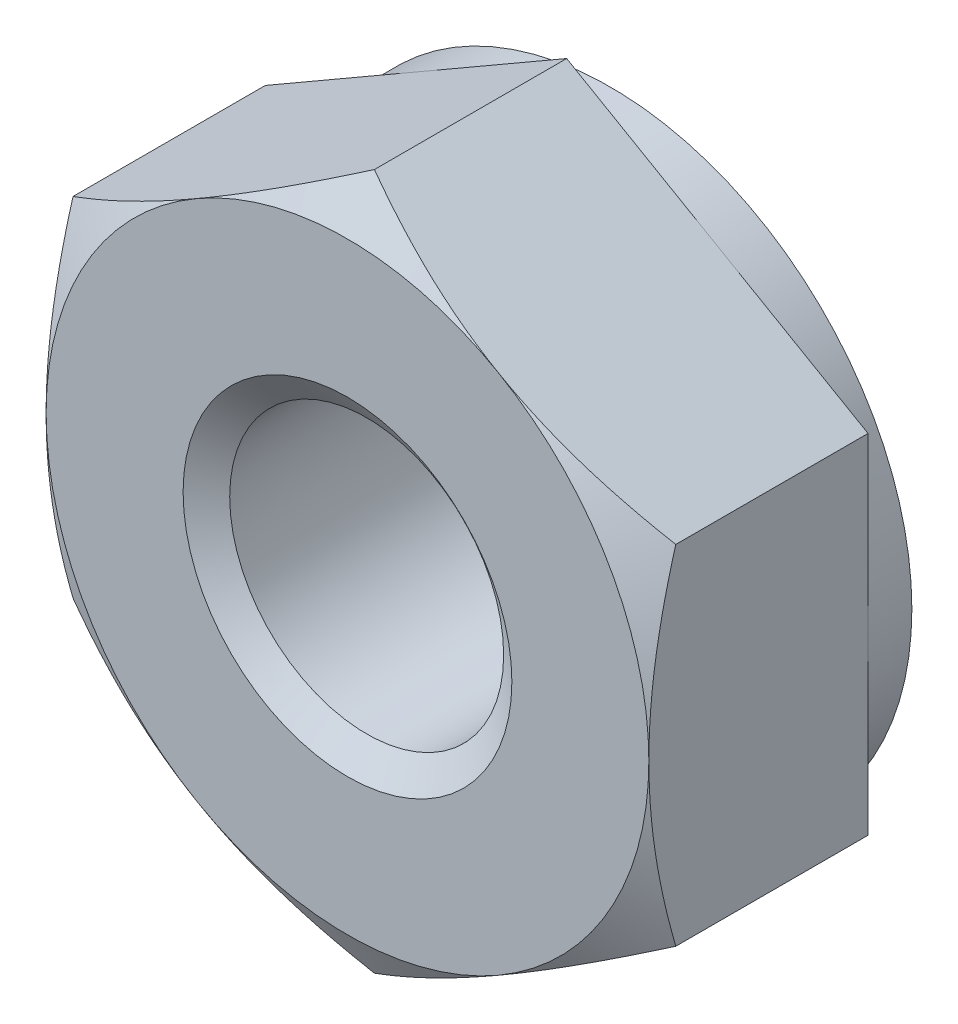
ISO-10303-21;
HEADER;
FILE_DESCRIPTION(('STEP AP214'),'2;1');
FILE_NAME('part.step','',(''),(''),'','','');
FILE_SCHEMA(('AUTOMOTIVE_DESIGN { 1 0 10303 214 1 1 1 1 }'));
ENDSEC;
DATA;
#1=APPLICATION_CONTEXT('core data for automotive mechanical design processes');
#2=APPLICATION_PROTOCOL_DEFINITION('international standard','automotive_design',2000,#1);
#3=PRODUCT_CONTEXT('',#1,'mechanical');
#4=PRODUCT('Part','Part','',(#3));
#5=PRODUCT_RELATED_PRODUCT_CATEGORY('part','',(#4));
#6=PRODUCT_DEFINITION_FORMATION('','',#4);
#7=PRODUCT_DEFINITION_CONTEXT('part definition',#1,'design');
#8=PRODUCT_DEFINITION('design','',#6,#7);
#9=PRODUCT_DEFINITION_SHAPE('','',#8);
#10=(LENGTH_UNIT() NAMED_UNIT(*) SI_UNIT(.MILLI.,.METRE.));
#11=(NAMED_UNIT(*) PLANE_ANGLE_UNIT() SI_UNIT($,.RADIAN.));
#12=(NAMED_UNIT(*) SI_UNIT($,.STERADIAN.) SOLID_ANGLE_UNIT());
#13=UNCERTAINTY_MEASURE_WITH_UNIT(LENGTH_MEASURE(1.E-05),#10,'distance_accuracy_value','');
#14=(GEOMETRIC_REPRESENTATION_CONTEXT(3) GLOBAL_UNCERTAINTY_ASSIGNED_CONTEXT((#13)) GLOBAL_UNIT_ASSIGNED_CONTEXT((#10,
#11,#12)) REPRESENTATION_CONTEXT('',''));
#15=CARTESIAN_POINT('',(0.,0.,0.));
#16=DIRECTION('',(0.,0.,1.));
#17=DIRECTION('',(1.,0.,0.));
#18=AXIS2_PLACEMENT_3D('',#15,#16,#17);
#19=CARTESIAN_POINT('',(0.,0.,-2.4));
#20=DIRECTION('',(0.,0.,1.));
#21=DIRECTION('',(1.,0.,0.));
#22=AXIS2_PLACEMENT_3D('',#19,#20,#21);
#23=CYLINDRICAL_SURFACE('',#22,1.25);
#24=CARTESIAN_POINT('',(0.,0.,-0.175051884552426));
#25=DIRECTION('',(0.,0.,1.));
#26=DIRECTION('',(1.,0.,0.));
#27=AXIS2_PLACEMENT_3D('',#24,#25,#26);
#28=CIRCLE('',#27,1.25);
#29=CARTESIAN_POINT('',(1.25,0.,-0.175051884552426));
#30=VERTEX_POINT('',#29);
#31=EDGE_CURVE('E149',#30,#30,#28,.F.);
#32=ORIENTED_EDGE('',*,*,#31,.F.);
#33=EDGE_LOOP('',(#32));
#34=FACE_BOUND('',#33,.T.);
#35=CARTESIAN_POINT('',(0.,0.,-2.19954811544757));
#36=DIRECTION('',(0.,0.,-1.));
#37=DIRECTION('',(-1.,0.,0.));
#38=AXIS2_PLACEMENT_3D('',#35,#36,#37);
#39=CIRCLE('',#38,1.25);
#40=CARTESIAN_POINT('',(-1.25,0.,-2.19954811544757));
#41=VERTEX_POINT('',#40);
#42=EDGE_CURVE('E37',#41,#41,#39,.F.);
#43=ORIENTED_EDGE('',*,*,#42,.F.);
#44=EDGE_LOOP('',(#43));
#45=FACE_BOUND('',#44,.T.);
#46=ADVANCED_FACE('F32',(#34,#45),#23,.F.);
#47=CARTESIAN_POINT('',(-5.49999999999999,0.,-2.4));
#48=DIRECTION('',(0.,0.,1.));
#49=DIRECTION('',(1.,0.,0.));
#50=AXIS2_PLACEMENT_3D('',#47,#48,#49);
#51=PLANE('',#50);
#52=CARTESIAN_POINT('',(0.,0.,-2.4));
#53=DIRECTION('',(0.,0.,1.));
#54=DIRECTION('',(1.,0.,0.));
#55=AXIS2_PLACEMENT_3D('',#52,#53,#54);
#56=CIRCLE('',#55,2.75);
#57=CARTESIAN_POINT('',(2.75,0.,-2.4));
#58=VERTEX_POINT('',#57);
#59=EDGE_CURVE('E273',#58,#58,#56,.F.);
#60=ORIENTED_EDGE('',*,*,#59,.T.);
#61=EDGE_LOOP('',(#60));
#62=FACE_BOUND('',#61,.T.);
#63=CARTESIAN_POINT('',(0.,0.,-2.4));
#64=DIRECTION('',(0.,0.,1.));
#65=DIRECTION('',(1.,0.,0.));
#66=AXIS2_PLACEMENT_3D('',#63,#64,#65);
#67=CIRCLE('',#66,1.5);
#68=CARTESIAN_POINT('',(1.5,0.,-2.4));
#69=VERTEX_POINT('',#68);
#70=EDGE_CURVE('E293',#69,#69,#67,.F.);
#71=ORIENTED_EDGE('',*,*,#70,.F.);
#72=EDGE_LOOP('',(#71));
#73=FACE_BOUND('',#72,.T.);
#74=ADVANCED_FACE('F225',(#62,#73),#51,.F.);
#75=CARTESIAN_POINT('',(-5.49999999999999,0.,0.));
#76=DIRECTION('',(0.,0.,1.));
#77=DIRECTION('',(1.,0.,0.));
#78=AXIS2_PLACEMENT_3D('',#75,#76,#77);
#79=PLANE('',#78);
#80=CARTESIAN_POINT('',(0.,0.,0.));
#81=DIRECTION('',(0.,0.,1.));
#82=DIRECTION('',(1.,0.,0.));
#83=AXIS2_PLACEMENT_3D('',#80,#81,#82);
#84=CIRCLE('',#83,2.75);
#85=CARTESIAN_POINT('',(2.75,0.,0.));
#86=VERTEX_POINT('',#85);
#87=CARTESIAN_POINT('',(1.375,-2.3815698604072,0.));
#88=VERTEX_POINT('',#87);
#89=EDGE_CURVE('E12',#86,#88,#84,.F.);
#90=ORIENTED_EDGE('',*,*,#89,.F.);
#91=CARTESIAN_POINT('',(0.,0.,0.));
#92=DIRECTION('',(0.,0.,1.));
#93=DIRECTION('',(1.,0.,0.));
#94=AXIS2_PLACEMENT_3D('',#91,#92,#93);
#95=CIRCLE('',#94,2.75);
#96=CARTESIAN_POINT('',(1.375,2.3815698604072,0.));
#97=VERTEX_POINT('',#96);
#98=EDGE_CURVE('E141',#86,#97,#95,.T.);
#99=ORIENTED_EDGE('',*,*,#98,.T.);
#100=CARTESIAN_POINT('',(-1.375,2.3815698604072,0.));
#101=VERTEX_POINT('',#100);
#102=EDGE_CURVE('E44',#101,#97,#84,.F.);
#103=ORIENTED_EDGE('',*,*,#102,.F.);
#104=CARTESIAN_POINT('',(-2.75,0.,0.));
#105=VERTEX_POINT('',#104);
#106=EDGE_CURVE('E354',#105,#101,#84,.F.);
#107=ORIENTED_EDGE('',*,*,#106,.F.);
#108=CARTESIAN_POINT('',(-1.375,-2.3815698604072,0.));
#109=VERTEX_POINT('',#108);
#110=EDGE_CURVE('E356',#109,#105,#84,.F.);
#111=ORIENTED_EDGE('',*,*,#110,.F.);
#112=EDGE_CURVE('E42',#88,#109,#84,.F.);
#113=ORIENTED_EDGE('',*,*,#112,.F.);
#114=EDGE_LOOP('',(#90,#99,#103,#107,#111,#113));
#115=FACE_BOUND('',#114,.T.);
#116=CARTESIAN_POINT('',(0.,0.,0.));
#117=DIRECTION('',(0.,0.,1.));
#118=DIRECTION('',(1.,0.,0.));
#119=AXIS2_PLACEMENT_3D('',#116,#117,#118);
#120=CIRCLE('',#119,1.5);
#121=CARTESIAN_POINT('',(1.5,0.,0.));
#122=VERTEX_POINT('',#121);
#123=EDGE_CURVE('E292',#122,#122,#120,.T.);
#124=ORIENTED_EDGE('',*,*,#123,.F.);
#125=EDGE_LOOP('',(#124));
#126=FACE_BOUND('',#125,.T.);
#127=ADVANCED_FACE('F151',(#115,#126),#79,.T.);
#128=CARTESIAN_POINT('',(0.,3.17542648054294,-2.4));
#129=DIRECTION('',(-0.500000000000001,0.866025403784438,0.));
#130=DIRECTION('',(-0.866025403784438,-0.500000000000002,0.));
#131=AXIS2_PLACEMENT_3D('',#128,#129,#130);
#132=PLANE('',#131);
#133=DIRECTION('',(0.,0.,1.));
#134=VECTOR('',#133,1.);
#135=CARTESIAN_POINT('',(-2.75,1.58771324027147,-2.4));
#136=LINE('',#135,#134);
#137=CARTESIAN_POINT('',(-2.75,1.58771324027147,-2.));
#138=VERTEX_POINT('',#137);
#139=CARTESIAN_POINT('',(-2.75,1.58771324027147,-0.245620093061864));
#140=VERTEX_POINT('',#139);
#141=EDGE_CURVE('E282',#138,#140,#136,.T.);
#142=ORIENTED_EDGE('',*,*,#141,.T.);
#143=CARTESIAN_POINT('',(-2.7502,1.58759777021763,-0.24568676336476));
#144=CARTESIAN_POINT('',(-2.62935077934009,1.65737010029698,-0.205387662249263));
#145=CARTESIAN_POINT('',(-2.50745839737737,1.72774469983533,-0.168736902597661));
#146=CARTESIAN_POINT('',(-2.26156287327211,1.86971254687002,-0.1047621829698));
#147=CARTESIAN_POINT('',(-2.13755536142614,1.94130831721583,-0.0774608556744965));
#148=CARTESIAN_POINT('',(-1.89107720202406,2.08361254889599,-0.034961745294116));
#149=CARTESIAN_POINT('',(-1.76864448141258,2.15429911309864,-0.0194811186224571));
#150=CARTESIAN_POINT('',(-1.52320285763109,2.29600490065923,-0.000999397369939877));
#151=CARTESIAN_POINT('',(-1.40019484676709,2.36702360884404,0.00201700053740089));
#152=CARTESIAN_POINT('',(-1.17034121338921,2.49972966594897,-0.0042531454285464));
#153=CARTESIAN_POINT('',(-1.06346120874598,2.56143686540073,-0.0120001542767023));
#154=CARTESIAN_POINT('',(-0.850397532665251,2.68444923614047,-0.0365551810643551));
#155=CARTESIAN_POINT('',(-0.744214598351112,2.74575398185008,-0.0533715896505706));
#156=CARTESIAN_POINT('',(-0.530711510606817,2.86902004703206,-0.0954119223459571));
#157=CARTESIAN_POINT('',(-0.423418383857146,2.93096576264318,-0.120814080687232));
#158=CARTESIAN_POINT('',(-0.21043252071595,3.05393320806134,-0.178467225839984));
#159=CARTESIAN_POINT('',(-0.104737054973348,3.11495651365995,-0.210704663298984));
#160=CARTESIAN_POINT('',(0.000199999999999367,3.17554195059678,-0.245686763364762));
#161=B_SPLINE_CURVE_WITH_KNOTS('',3,(#143,#144,#145,#146,#147,#148,#149,#150,#151,#152,#153,
#154,#155,#156,#157,#158,#159,#160),.UNSPECIFIED.,.F.,.F.,(4,2,2,2,2,2,2,2,4),(0.,
0.435912828725889,0.872873557116333,1.29901931904672,1.72464171213574,2.09526089052938,
2.46622354066374,2.84541551798557,3.22386274754525),.UNSPECIFIED.);
#162=EDGE_CURVE('E135',#140,#101,#161,.T.);
#163=ORIENTED_EDGE('',*,*,#162,.T.);
#164=CARTESIAN_POINT('',(0.,3.17542648054294,-0.245620093061864));
#165=VERTEX_POINT('',#164);
#166=EDGE_CURVE('E163',#101,#165,#161,.T.);
#167=ORIENTED_EDGE('',*,*,#166,.T.);
#168=DIRECTION('',(0.,0.,1.));
#169=VECTOR('',#168,1.);
#170=CARTESIAN_POINT('',(0.,3.17542648054294,-2.4));
#171=LINE('',#170,#169);
#172=CARTESIAN_POINT('',(0.,3.17542648054294,-2.));
#173=VERTEX_POINT('',#172);
#174=EDGE_CURVE('E270',#173,#165,#171,.T.);
#175=ORIENTED_EDGE('',*,*,#174,.F.);
#176=DIRECTION('',(-0.866025403784438,-0.500000000000002,0.));
#177=VECTOR('',#176,1.);
#178=CARTESIAN_POINT('',(0.,3.17542648054294,-2.));
#179=LINE('',#178,#177);
#180=CARTESIAN_POINT('',(-1.375,2.3815698604072,-2.));
#181=VERTEX_POINT('',#180);
#182=EDGE_CURVE('E258',#173,#181,#179,.T.);
#183=ORIENTED_EDGE('',*,*,#182,.T.);
#184=EDGE_CURVE('E254',#181,#138,#179,.T.);
#185=ORIENTED_EDGE('',*,*,#184,.T.);
#186=EDGE_LOOP('',(#142,#163,#167,#175,#183,#185));
#187=FACE_BOUND('',#186,.T.);
#188=ADVANCED_FACE('F34',(#187),#132,.T.);
#189=CARTESIAN_POINT('',(2.75,1.58771324027147,-2.4));
#190=DIRECTION('',(0.500000000000001,0.866025403784438,0.));
#191=DIRECTION('',(-0.866025403784438,0.500000000000001,0.));
#192=AXIS2_PLACEMENT_3D('',#189,#190,#191);
#193=PLANE('',#192);
#194=ORIENTED_EDGE('',*,*,#174,.T.);
#195=CARTESIAN_POINT('',(-0.000200000000000543,3.17554195059678,-0.245686763364762));
#196=CARTESIAN_POINT('',(0.120649220659906,3.10576962051743,-0.205387662249265));
#197=CARTESIAN_POINT('',(0.242541602622633,3.03539502097908,-0.168736902597664));
#198=CARTESIAN_POINT('',(0.488437126727892,2.89342717394439,-0.104762182969802));
#199=CARTESIAN_POINT('',(0.612444638573855,2.82183140359858,-0.077460855674498));
#200=CARTESIAN_POINT('',(0.858922797975944,2.67952717191843,-0.0349617452941172));
#201=CARTESIAN_POINT('',(0.981355518587418,2.60884060771577,-0.0194811186224581));
#202=CARTESIAN_POINT('',(1.22679714236892,2.46713482015518,-0.000999397369940369));
#203=CARTESIAN_POINT('',(1.34980515323291,2.39611611197038,0.00201700053740071));
#204=CARTESIAN_POINT('',(1.57965878661079,2.26341005486544,-0.00425314542854611));
#205=CARTESIAN_POINT('',(1.68653879125402,2.20170285541369,-0.0120001542767019));
#206=CARTESIAN_POINT('',(1.89960246733475,2.07869048467395,-0.0365551810643542));
#207=CARTESIAN_POINT('',(2.00578540164889,2.01738573896433,-0.0533715896505696));
#208=CARTESIAN_POINT('',(2.21928848939318,1.89411967378235,-0.0954119223459556));
#209=CARTESIAN_POINT('',(2.32658161614285,1.83217395817123,-0.12081408068723));
#210=CARTESIAN_POINT('',(2.53956747928405,1.70920651275307,-0.178467225839982));
#211=CARTESIAN_POINT('',(2.64526294502665,1.64818320715446,-0.210704663298982));
#212=CARTESIAN_POINT('',(2.7502,1.58759777021763,-0.24568676336476));
#213=B_SPLINE_CURVE_WITH_KNOTS('',3,(#195,#196,#197,#198,#199,#200,#201,#202,#203,#204,#205,
#206,#207,#208,#209,#210,#211,#212),.UNSPECIFIED.,.F.,.F.,(4,2,2,2,2,2,2,2,4),(0.,
0.435912828725889,0.872873557116333,1.29901931904672,1.72464171213574,2.09526089052938,
2.46622354066375,2.84541551798557,3.22386274754525),.UNSPECIFIED.);
#214=EDGE_CURVE('E159',#165,#97,#213,.T.);
#215=ORIENTED_EDGE('',*,*,#214,.T.);
#216=CARTESIAN_POINT('',(2.75,1.58771324027148,-0.245620093061864));
#217=VERTEX_POINT('',#216);
#218=EDGE_CURVE('E144',#97,#217,#213,.T.);
#219=ORIENTED_EDGE('',*,*,#218,.T.);
#220=DIRECTION('',(0.,0.,1.));
#221=VECTOR('',#220,1.);
#222=CARTESIAN_POINT('',(2.75,1.58771324027147,-2.4));
#223=LINE('',#222,#221);
#224=CARTESIAN_POINT('',(2.75,1.58771324027147,-2.));
#225=VERTEX_POINT('',#224);
#226=EDGE_CURVE('E158',#225,#217,#223,.T.);
#227=ORIENTED_EDGE('',*,*,#226,.F.);
#228=DIRECTION('',(-0.866025403784438,0.500000000000001,0.));
#229=VECTOR('',#228,1.);
#230=CARTESIAN_POINT('',(2.75,1.58771324027147,-2.));
#231=LINE('',#230,#229);
#232=CARTESIAN_POINT('',(1.375,2.3815698604072,-2.));
#233=VERTEX_POINT('',#232);
#234=EDGE_CURVE('E266',#225,#233,#231,.T.);
#235=ORIENTED_EDGE('',*,*,#234,.T.);
#236=EDGE_CURVE('E262',#233,#173,#231,.T.);
#237=ORIENTED_EDGE('',*,*,#236,.T.);
#238=EDGE_LOOP('',(#194,#215,#219,#227,#235,#237));
#239=FACE_BOUND('',#238,.T.);
#240=ADVANCED_FACE('F238',(#239),#193,.T.);
#241=CARTESIAN_POINT('',(2.75,1.58771324027147,-2.4));
#242=DIRECTION('',(-1.,0.,0.));
#243=DIRECTION('',(0.,0.,1.));
#244=AXIS2_PLACEMENT_3D('',#241,#242,#243);
#245=PLANE('',#244);
#246=CARTESIAN_POINT('',(2.75,-4.21084949309676,-1.31594843960294));
#247=CARTESIAN_POINT('',(2.75,-4.0901089421409,-1.25759993615224));
#248=CARTESIAN_POINT('',(2.75,-3.96908292065509,-1.19983146511759));
#249=CARTESIAN_POINT('',(2.75,-3.72630558284844,-1.08578603842305));
#250=CARTESIAN_POINT('',(2.75,-3.604554145362,-1.02950934100247));
#251=CARTESIAN_POINT('',(2.75,-3.35951393034355,-0.918482443352758));
#252=CARTESIAN_POINT('',(2.75,-3.23622034236437,-0.863742821605839));
#253=CARTESIAN_POINT('',(2.75,-2.98861980138744,-0.756614777476455));
#254=CARTESIAN_POINT('',(2.75,-2.86431290161182,-0.704226232536764));
#255=CARTESIAN_POINT('',(2.75,-2.61294485887172,-0.601803572146124));
#256=CARTESIAN_POINT('',(2.75,-2.48586863815654,-0.551806257898394));
#257=CARTESIAN_POINT('',(2.75,-2.23021732171541,-0.455727408784601));
#258=CARTESIAN_POINT('',(2.75,-2.10164206103363,-0.409646309576972));
#259=CARTESIAN_POINT('',(2.75,-1.84305218799467,-0.322638077046231));
#260=CARTESIAN_POINT('',(2.75,-1.71304130052583,-0.281699986413888));
#261=CARTESIAN_POINT('',(2.75,-1.45117125062148,-0.206307307624348));
#262=CARTESIAN_POINT('',(2.75,-1.31931268690202,-0.171850669152767));
#263=CARTESIAN_POINT('',(2.75,-1.05365722480013,-0.111093671530904));
#264=CARTESIAN_POINT('',(2.75,-0.919859820217592,-0.0847954840951216));
#265=CARTESIAN_POINT('',(2.75,-0.650651874037382,-0.0421260371966112));
#266=CARTESIAN_POINT('',(2.75,-0.515241331013596,-0.0257547865105431));
#267=CARTESIAN_POINT('',(2.75,-0.244373242869212,-0.00438749654023743));
#268=CARTESIAN_POINT('',(2.75,-0.108921526377135,0.000680556773215956));
#269=CARTESIAN_POINT('',(2.75,0.161887058855133,-0.000827795632672008));
#270=CARTESIAN_POINT('',(2.75,0.297243943089639,-0.00740117868555373));
#271=CARTESIAN_POINT('',(2.75,0.528385436717541,-0.0281041300468437));
#272=CARTESIAN_POINT('',(2.75,0.6244250501375,-0.0395376410301881));
#273=CARTESIAN_POINT('',(2.75,0.815762399811543,-0.0675217196133508));
#274=CARTESIAN_POINT('',(2.75,0.911060016631965,-0.0840730942276822));
#275=CARTESIAN_POINT('',(2.75,1.19576218748916,-0.140535361278284));
#276=CARTESIAN_POINT('',(2.75,1.38383224738497,-0.187239859417294));
#277=CARTESIAN_POINT('',(2.75,1.66525048947485,-0.267792497030579));
#278=CARTESIAN_POINT('',(2.75,1.76006556248558,-0.296803334995501));
#279=CARTESIAN_POINT('',(2.75,1.94870609382215,-0.357695648906588));
#280=CARTESIAN_POINT('',(2.75,2.04253218553696,-0.389575144878504));
#281=CARTESIAN_POINT('',(2.75,2.22880240354985,-0.455541418186448));
#282=CARTESIAN_POINT('',(2.75,2.32125133588452,-0.489614761455533));
#283=CARTESIAN_POINT('',(2.75,2.50543192042629,-0.559761368231109));
#284=CARTESIAN_POINT('',(2.75,2.59716326539579,-0.595835440037318));
#285=CARTESIAN_POINT('',(2.75,2.68856293053346,-0.632712441997484));
#286=B_SPLINE_CURVE_WITH_KNOTS('',3,(#246,#247,#248,#249,#250,#251,#252,#253,#254,#255,#256,
#257,#258,#259,#260,#261,#262,#263,#264,#265,#266,#267,#268,#269,#270,#271,#272,#273,#274,#275,
#276,#277,#278,#279,#280,#281,#282,#283,#284,#285),.UNSPECIFIED.,.F.,.F.,(4,2,2,2,2,2,2,2,2,2,2,
2,2,2,2,2,2,2,2,4),(0.,0.402305607365937,0.804680408536998,1.20935783819118,1.61401414820819,
2.0236383818577,2.43330812457349,2.84208969479601,3.25074173456637,3.65950246109144,
4.06826354901184,4.4744128402465,4.88045669141172,5.17046846817546,5.46052599902452,
6.04107275309883,6.33851131304662,6.63574613017455,6.93130791005793,7.22698998004823),.UNSPECIFIED.);
#287=CARTESIAN_POINT('',(2.75,-1.58771324027148,-0.245620093061864));
#288=VERTEX_POINT('',#287);
#289=EDGE_CURVE('E124',#288,#86,#286,.T.);
#290=ORIENTED_EDGE('',*,*,#289,.F.);
#291=DIRECTION('',(0.,0.,1.));
#292=VECTOR('',#291,1.);
#293=CARTESIAN_POINT('',(2.75,-1.58771324027148,-2.4));
#294=LINE('',#293,#292);
#295=CARTESIAN_POINT('',(2.75,-1.58771324027148,-2.));
#296=VERTEX_POINT('',#295);
#297=EDGE_CURVE('E275',#296,#288,#294,.T.);
#298=ORIENTED_EDGE('',*,*,#297,.F.);
#299=DIRECTION('',(0.,-1.,0.));
#300=VECTOR('',#299,1.);
#301=CARTESIAN_POINT('',(2.75,1.58771324027147,-2.));
#302=LINE('',#301,#300);
#303=CARTESIAN_POINT('',(2.75,0.,-2.));
#304=VERTEX_POINT('',#303);
#305=EDGE_CURVE('E267',#304,#296,#302,.T.);
#306=ORIENTED_EDGE('',*,*,#305,.F.);
#307=EDGE_CURVE('E269',#225,#304,#302,.T.);
#308=ORIENTED_EDGE('',*,*,#307,.F.);
#309=ORIENTED_EDGE('',*,*,#226,.T.);
#310=EDGE_CURVE('E137',#86,#217,#286,.T.);
#311=ORIENTED_EDGE('',*,*,#310,.F.);
#312=EDGE_LOOP('',(#290,#298,#306,#308,#309,#311));
#313=FACE_BOUND('',#312,.T.);
#314=ADVANCED_FACE('F155',(#313),#245,.F.);
#315=CARTESIAN_POINT('',(0.,-3.17542648054295,-2.4));
#316=DIRECTION('',(0.500000000000001,-0.866025403784438,0.));
#317=DIRECTION('',(0.866025403784438,0.500000000000002,0.));
#318=AXIS2_PLACEMENT_3D('',#315,#316,#317);
#319=PLANE('',#318);
#320=ORIENTED_EDGE('',*,*,#297,.T.);
#321=CARTESIAN_POINT('',(2.7502,-1.58759777021764,-0.245686763364762));
#322=CARTESIAN_POINT('',(2.62935077934009,-1.65737010029699,-0.205387662249265));
#323=CARTESIAN_POINT('',(2.50745839737737,-1.72774469983534,-0.168736902597664));
#324=CARTESIAN_POINT('',(2.26156287327211,-1.86971254687003,-0.104762182969803));
#325=CARTESIAN_POINT('',(2.13755536142614,-1.94130831721584,-0.0774608556745));
#326=CARTESIAN_POINT('',(1.89107720202406,-2.083612548896,-0.0349617452941197));
#327=CARTESIAN_POINT('',(1.76864448141258,-2.15429911309865,-0.0194811186224608));
#328=CARTESIAN_POINT('',(1.52320285763108,-2.29600490065924,-0.000999397369943824));
#329=CARTESIAN_POINT('',(1.40019484676709,-2.36702360884405,0.0020170005373966));
#330=CARTESIAN_POINT('',(1.17034121338921,-2.49972966594898,-0.00425314542855109));
#331=CARTESIAN_POINT('',(1.06346120874598,-2.56143686540074,-0.0120001542767071));
#332=CARTESIAN_POINT('',(0.85039753266525,-2.68444923614048,-0.0365551810643601));
#333=CARTESIAN_POINT('',(0.74421459835111,-2.74575398185009,-0.0533715896505758));
#334=CARTESIAN_POINT('',(0.530711510606816,-2.86902004703207,-0.0954119223459622));
#335=CARTESIAN_POINT('',(0.423418383857145,-2.93096576264319,-0.120814080687237));
#336=CARTESIAN_POINT('',(0.210432520715949,-3.05393320806135,-0.178467225839988));
#337=CARTESIAN_POINT('',(0.104737054973347,-3.11495651365996,-0.210704663298989));
#338=CARTESIAN_POINT('',(-0.000199999999999801,-3.17554195059679,-0.245686763364767));
#339=B_SPLINE_CURVE_WITH_KNOTS('',3,(#321,#322,#323,#324,#325,#326,#327,#328,#329,#330,#331,
#332,#333,#334,#335,#336,#337,#338),.UNSPECIFIED.,.F.,.F.,(4,2,2,2,2,2,2,2,4),(0.,
0.435912828725889,0.872873557116334,1.29901931904672,1.72464171213574,2.09526089052938,
2.46622354066375,2.84541551798557,3.22386274754525),.UNSPECIFIED.);
#340=EDGE_CURVE('E130',#288,#88,#339,.T.);
#341=ORIENTED_EDGE('',*,*,#340,.T.);
#342=CARTESIAN_POINT('',(0.,-3.17542648054294,-0.245620093061864));
#343=VERTEX_POINT('',#342);
#344=EDGE_CURVE('E51',#88,#343,#339,.T.);
#345=ORIENTED_EDGE('',*,*,#344,.T.);
#346=DIRECTION('',(0.,0.,1.));
#347=VECTOR('',#346,1.);
#348=CARTESIAN_POINT('',(0.,-3.17542648054295,-2.4));
#349=LINE('',#348,#347);
#350=CARTESIAN_POINT('',(0.,-3.17542648054295,-2.));
#351=VERTEX_POINT('',#350);
#352=EDGE_CURVE('E277',#351,#343,#349,.T.);
#353=ORIENTED_EDGE('',*,*,#352,.F.);
#354=DIRECTION('',(0.866025403784438,0.500000000000002,0.));
#355=VECTOR('',#354,1.);
#356=CARTESIAN_POINT('',(0.,-3.17542648054295,-2.));
#357=LINE('',#356,#355);
#358=CARTESIAN_POINT('',(1.37500000000001,-2.38156986040721,-2.));
#359=VERTEX_POINT('',#358);
#360=EDGE_CURVE('E259',#351,#359,#357,.T.);
#361=ORIENTED_EDGE('',*,*,#360,.T.);
#362=EDGE_CURVE('E263',#359,#296,#357,.T.);
#363=ORIENTED_EDGE('',*,*,#362,.T.);
#364=EDGE_LOOP('',(#320,#341,#345,#353,#361,#363));
#365=FACE_BOUND('',#364,.T.);
#366=ADVANCED_FACE('F211',(#365),#319,.T.);
#367=CARTESIAN_POINT('',(-2.75,-1.58771324027148,-2.4));
#368=DIRECTION('',(-0.500000000000001,-0.866025403784438,0.));
#369=DIRECTION('',(0.866025403784438,-0.500000000000001,0.));
#370=AXIS2_PLACEMENT_3D('',#367,#368,#369);
#371=PLANE('',#370);
#372=ORIENTED_EDGE('',*,*,#352,.T.);
#373=CARTESIAN_POINT('',(0.000200000000000438,-3.17554195059679,-0.245686763364767));
#374=CARTESIAN_POINT('',(-0.120649220659906,-3.10576962051744,-0.20538766224927));
#375=CARTESIAN_POINT('',(-0.242541602622634,-3.03539502097909,-0.168736902597668));
#376=CARTESIAN_POINT('',(-0.488437126727894,-2.89342717394439,-0.104762182969806));
#377=CARTESIAN_POINT('',(-0.612444638573857,-2.82183140359859,-0.0774608556745026));
#378=CARTESIAN_POINT('',(-0.858922797975946,-2.67952717191843,-0.0349617452941216));
#379=CARTESIAN_POINT('',(-0.98135551858742,-2.60884060771578,-0.0194811186224624));
#380=CARTESIAN_POINT('',(-1.22679714236892,-2.46713482015519,-0.00099939736994477));
#381=CARTESIAN_POINT('',(-1.34980515323292,-2.39611611197038,0.00201700053739621));
#382=CARTESIAN_POINT('',(-1.5796587866108,-2.26341005486545,-0.00425314542855061));
#383=CARTESIAN_POINT('',(-1.68653879125403,-2.20170285541369,-0.0120001542767062));
#384=CARTESIAN_POINT('',(-1.89960246733475,-2.07869048467395,-0.0365551810643584));
#385=CARTESIAN_POINT('',(-2.00578540164889,-2.01738573896434,-0.0533715896505739));
#386=CARTESIAN_POINT('',(-2.21928848939319,-1.89411967378236,-0.0954119223459596));
#387=CARTESIAN_POINT('',(-2.32658161614286,-1.83217395817124,-0.120814080687234));
#388=CARTESIAN_POINT('',(-2.53956747928405,-1.70920651275308,-0.178467225839984));
#389=CARTESIAN_POINT('',(-2.64526294502665,-1.64818320715447,-0.210704663298985));
#390=CARTESIAN_POINT('',(-2.7502,-1.58759777021764,-0.245686763364762));
#391=B_SPLINE_CURVE_WITH_KNOTS('',3,(#373,#374,#375,#376,#377,#378,#379,#380,#381,#382,#383,
#384,#385,#386,#387,#388,#389,#390),.UNSPECIFIED.,.F.,.F.,(4,2,2,2,2,2,2,2,4),(0.,
0.43591282872589,0.872873557116336,1.29901931904672,1.72464171213574,2.09526089052938,
2.46622354066375,2.84541551798558,3.22386274754524),.UNSPECIFIED.);
#392=EDGE_CURVE('E205',#343,#109,#391,.T.);
#393=ORIENTED_EDGE('',*,*,#392,.T.);
#394=CARTESIAN_POINT('',(-2.75,-1.58771324027148,-0.245620093061864));
#395=VERTEX_POINT('',#394);
#396=EDGE_CURVE('E58',#109,#395,#391,.T.);
#397=ORIENTED_EDGE('',*,*,#396,.T.);
#398=DIRECTION('',(0.,0.,1.));
#399=VECTOR('',#398,1.);
#400=CARTESIAN_POINT('',(-2.75,-1.58771324027148,-2.4));
#401=LINE('',#400,#399);
#402=CARTESIAN_POINT('',(-2.75,-1.58771324027148,-2.));
#403=VERTEX_POINT('',#402);
#404=EDGE_CURVE('E280',#403,#395,#401,.T.);
#405=ORIENTED_EDGE('',*,*,#404,.F.);
#406=DIRECTION('',(0.866025403784438,-0.500000000000001,0.));
#407=VECTOR('',#406,1.);
#408=CARTESIAN_POINT('',(-2.75,-1.58771324027148,-2.));
#409=LINE('',#408,#407);
#410=CARTESIAN_POINT('',(-1.37500000000001,-2.38156986040721,-2.));
#411=VERTEX_POINT('',#410);
#412=EDGE_CURVE('E249',#403,#411,#409,.T.);
#413=ORIENTED_EDGE('',*,*,#412,.T.);
#414=EDGE_CURVE('E255',#411,#351,#409,.T.);
#415=ORIENTED_EDGE('',*,*,#414,.T.);
#416=EDGE_LOOP('',(#372,#393,#397,#405,#413,#415));
#417=FACE_BOUND('',#416,.T.);
#418=ADVANCED_FACE('F207',(#417),#371,.T.);
#419=CARTESIAN_POINT('',(-2.75,1.58771324027147,-2.4));
#420=DIRECTION('',(-1.,0.,0.));
#421=DIRECTION('',(0.,0.,1.));
#422=AXIS2_PLACEMENT_3D('',#419,#420,#421);
#423=PLANE('',#422);
#424=ORIENTED_EDGE('',*,*,#404,.T.);
#425=CARTESIAN_POINT('',(-2.75,-4.21084949309676,-1.31594843960294));
#426=CARTESIAN_POINT('',(-2.75,-4.0901089421409,-1.25759993615224));
#427=CARTESIAN_POINT('',(-2.75,-3.9690829206551,-1.19983146511759));
#428=CARTESIAN_POINT('',(-2.75,-3.72630558284844,-1.08578603842305));
#429=CARTESIAN_POINT('',(-2.75,-3.60455414536201,-1.02950934100247));
#430=CARTESIAN_POINT('',(-2.75,-3.35951393034355,-0.918482443352759));
#431=CARTESIAN_POINT('',(-2.75,-3.23622034236437,-0.86374282160584));
#432=CARTESIAN_POINT('',(-2.75,-2.98861980138744,-0.756614777476455));
#433=CARTESIAN_POINT('',(-2.75,-2.86431290161182,-0.704226232536765));
#434=CARTESIAN_POINT('',(-2.75,-2.61294485887172,-0.601803572146125));
#435=CARTESIAN_POINT('',(-2.75,-2.48586863815654,-0.551806257898395));
#436=CARTESIAN_POINT('',(-2.75,-2.23021732171541,-0.455727408784602));
#437=CARTESIAN_POINT('',(-2.75,-2.10164206103364,-0.409646309576972));
#438=CARTESIAN_POINT('',(-2.75,-1.84305218799467,-0.322638077046232));
#439=CARTESIAN_POINT('',(-2.75,-1.71304130052584,-0.281699986413889));
#440=CARTESIAN_POINT('',(-2.75,-1.45117125062148,-0.206307307624349));
#441=CARTESIAN_POINT('',(-2.75,-1.31931268690203,-0.171850669152768));
#442=CARTESIAN_POINT('',(-2.75,-1.05365722480013,-0.111093671530904));
#443=CARTESIAN_POINT('',(-2.75,-0.919859820217594,-0.0847954840951218));
#444=CARTESIAN_POINT('',(-2.75,-0.650651874037384,-0.0421260371966115));
#445=CARTESIAN_POINT('',(-2.75,-0.515241331013598,-0.0257547865105434));
#446=CARTESIAN_POINT('',(-2.75,-0.244373242869214,-0.00438749654023761));
#447=CARTESIAN_POINT('',(-2.75,-0.108921526377136,0.000680556773215857));
#448=CARTESIAN_POINT('',(-2.75,0.161887058855132,-0.000827795632671907));
#449=CARTESIAN_POINT('',(-2.75,0.297243943089638,-0.00740117868555349));
#450=CARTESIAN_POINT('',(-2.75,0.52838543671754,-0.0281041300468435));
#451=CARTESIAN_POINT('',(-2.75,0.624425050137499,-0.0395376410301878));
#452=CARTESIAN_POINT('',(-2.75,0.815762399811542,-0.0675217196133505));
#453=CARTESIAN_POINT('',(-2.75,0.911060016631964,-0.0840730942276818));
#454=CARTESIAN_POINT('',(-2.75,1.19576218748916,-0.140535361278284));
#455=CARTESIAN_POINT('',(-2.75,1.38383224738496,-0.187239859417293));
#456=CARTESIAN_POINT('',(-2.75,1.66525048947485,-0.267792497030578));
#457=CARTESIAN_POINT('',(-2.75,1.76006556248558,-0.296803334995501));
#458=CARTESIAN_POINT('',(-2.75,1.94870609382215,-0.357695648906587));
#459=CARTESIAN_POINT('',(-2.75,2.04253218553696,-0.389575144878503));
#460=CARTESIAN_POINT('',(-2.75,2.22880240354984,-0.455541418186447));
#461=CARTESIAN_POINT('',(-2.75,2.32125133588451,-0.489614761455532));
#462=CARTESIAN_POINT('',(-2.75,2.50543192042628,-0.559761368231108));
#463=CARTESIAN_POINT('',(-2.75,2.59716326539579,-0.595835440037317));
#464=CARTESIAN_POINT('',(-2.75,2.68856293053345,-0.632712441997483));
#465=B_SPLINE_CURVE_WITH_KNOTS('',3,(#425,#426,#427,#428,#429,#430,#431,#432,#433,#434,#435,
#436,#437,#438,#439,#440,#441,#442,#443,#444,#445,#446,#447,#448,#449,#450,#451,#452,#453,#454,
#455,#456,#457,#458,#459,#460,#461,#462,#463,#464),.UNSPECIFIED.,.F.,.F.,(4,2,2,2,2,2,2,2,2,2,2,
2,2,2,2,2,2,2,2,4),(0.,0.402305607365937,0.804680408536998,1.20935783819118,1.61401414820819,
2.0236383818577,2.43330812457349,2.84208969479601,3.25074173456637,3.65950246109144,
4.06826354901184,4.4744128402465,4.88045669141172,5.17046846817546,5.46052599902453,
6.04107275309883,6.33851131304662,6.63574613017455,6.93130791005792,7.22698998004823),.UNSPECIFIED.);
#466=EDGE_CURVE('E206',#395,#105,#465,.T.);
#467=ORIENTED_EDGE('',*,*,#466,.T.);
#468=EDGE_CURVE('E148',#105,#140,#465,.T.);
#469=ORIENTED_EDGE('',*,*,#468,.T.);
#470=ORIENTED_EDGE('',*,*,#141,.F.);
#471=DIRECTION('',(0.,-1.,0.));
#472=VECTOR('',#471,1.);
#473=CARTESIAN_POINT('',(-2.75,1.58771324027147,-2.));
#474=LINE('',#473,#472);
#475=CARTESIAN_POINT('',(-2.75,0.,-2.));
#476=VERTEX_POINT('',#475);
#477=EDGE_CURVE('E289',#138,#476,#474,.T.);
#478=ORIENTED_EDGE('',*,*,#477,.T.);
#479=EDGE_CURVE('E287',#476,#403,#474,.T.);
#480=ORIENTED_EDGE('',*,*,#479,.T.);
#481=EDGE_LOOP('',(#424,#467,#469,#470,#478,#480));
#482=FACE_BOUND('',#481,.T.);
#483=ADVANCED_FACE('F210',(#482),#423,.T.);
#484=CARTESIAN_POINT('',(0.,13.1754264805429,-2.));
#485=DIRECTION('',(0.,0.,-1.));
#486=DIRECTION('',(-1.,0.,0.));
#487=AXIS2_PLACEMENT_3D('',#484,#485,#486);
#488=PLANE('',#487);
#489=ORIENTED_EDGE('',*,*,#307,.T.);
#490=CARTESIAN_POINT('',(0.,0.,-2.));
#491=DIRECTION('',(0.,0.,1.));
#492=DIRECTION('',(1.,0.,0.));
#493=AXIS2_PLACEMENT_3D('',#490,#491,#492);
#494=CIRCLE('',#493,2.75);
#495=EDGE_CURVE('E246',#304,#233,#494,.T.);
#496=ORIENTED_EDGE('',*,*,#495,.T.);
#497=ORIENTED_EDGE('',*,*,#234,.F.);
#498=EDGE_LOOP('',(#489,#496,#497));
#499=FACE_BOUND('',#498,.T.);
#500=ADVANCED_FACE('F216',(#499),#488,.T.);
#501=ORIENTED_EDGE('',*,*,#305,.T.);
#502=ORIENTED_EDGE('',*,*,#362,.F.);
#503=EDGE_CURVE('E251',#359,#304,#494,.T.);
#504=ORIENTED_EDGE('',*,*,#503,.T.);
#505=EDGE_LOOP('',(#501,#502,#504));
#506=FACE_BOUND('',#505,.T.);
#507=ADVANCED_FACE('F221',(#506),#488,.T.);
#508=EDGE_CURVE('E250',#233,#181,#494,.T.);
#509=ORIENTED_EDGE('',*,*,#508,.T.);
#510=ORIENTED_EDGE('',*,*,#182,.F.);
#511=ORIENTED_EDGE('',*,*,#236,.F.);
#512=EDGE_LOOP('',(#509,#510,#511));
#513=FACE_BOUND('',#512,.T.);
#514=ADVANCED_FACE('F340',(#513),#488,.T.);
#515=ORIENTED_EDGE('',*,*,#414,.F.);
#516=EDGE_CURVE('E371',#411,#359,#494,.T.);
#517=ORIENTED_EDGE('',*,*,#516,.T.);
#518=ORIENTED_EDGE('',*,*,#360,.F.);
#519=EDGE_LOOP('',(#515,#517,#518));
#520=FACE_BOUND('',#519,.T.);
#521=ADVANCED_FACE('F335',(#520),#488,.T.);
#522=EDGE_CURVE('E344',#181,#476,#494,.T.);
#523=ORIENTED_EDGE('',*,*,#522,.T.);
#524=ORIENTED_EDGE('',*,*,#477,.F.);
#525=ORIENTED_EDGE('',*,*,#184,.F.);
#526=EDGE_LOOP('',(#523,#524,#525));
#527=FACE_BOUND('',#526,.T.);
#528=ADVANCED_FACE('F329',(#527),#488,.T.);
#529=CARTESIAN_POINT('',(0.,0.,0.));
#530=DIRECTION('',(0.,0.,1.));
#531=DIRECTION('',(1.,0.,0.));
#532=AXIS2_PLACEMENT_3D('',#529,#530,#531);
#533=CYLINDRICAL_SURFACE('',#532,2.75);
#534=ORIENTED_EDGE('',*,*,#59,.F.);
#535=EDGE_LOOP('',(#534));
#536=FACE_BOUND('',#535,.T.);
#537=ORIENTED_EDGE('',*,*,#508,.F.);
#538=ORIENTED_EDGE('',*,*,#495,.F.);
#539=ORIENTED_EDGE('',*,*,#503,.F.);
#540=ORIENTED_EDGE('',*,*,#516,.F.);
#541=EDGE_CURVE('E350',#476,#411,#494,.T.);
#542=ORIENTED_EDGE('',*,*,#541,.F.);
#543=ORIENTED_EDGE('',*,*,#522,.F.);
#544=EDGE_LOOP('',(#537,#538,#539,#540,#542,#543));
#545=FACE_BOUND('',#544,.T.);
#546=ADVANCED_FACE('F235',(#536,#545),#533,.T.);
#547=ORIENTED_EDGE('',*,*,#479,.F.);
#548=ORIENTED_EDGE('',*,*,#541,.T.);
#549=ORIENTED_EDGE('',*,*,#412,.F.);
#550=EDGE_LOOP('',(#547,#548,#549));
#551=FACE_BOUND('',#550,.T.);
#552=ADVANCED_FACE('F190',(#551),#488,.T.);
#553=CARTESIAN_POINT('',(0.,0.,0.));
#554=DIRECTION('',(0.,0.,-1.));
#555=DIRECTION('',(-1.,0.,0.));
#556=AXIS2_PLACEMENT_3D('',#553,#554,#555);
#557=CONICAL_SURFACE('',#556,2.75,1.0471975511966);
#558=ORIENTED_EDGE('',*,*,#98,.F.);
#559=ORIENTED_EDGE('',*,*,#310,.T.);
#560=ORIENTED_EDGE('',*,*,#218,.F.);
#561=EDGE_LOOP('',(#558,#559,#560));
#562=FACE_BOUND('',#561,.T.);
#563=ADVANCED_FACE('F142',(#562),#557,.T.);
#564=ORIENTED_EDGE('',*,*,#102,.T.);
#565=ORIENTED_EDGE('',*,*,#214,.F.);
#566=ORIENTED_EDGE('',*,*,#166,.F.);
#567=EDGE_LOOP('',(#564,#565,#566));
#568=FACE_BOUND('',#567,.T.);
#569=ADVANCED_FACE('F187',(#568),#557,.T.);
#570=ORIENTED_EDGE('',*,*,#468,.F.);
#571=ORIENTED_EDGE('',*,*,#106,.T.);
#572=ORIENTED_EDGE('',*,*,#162,.F.);
#573=EDGE_LOOP('',(#570,#571,#572));
#574=FACE_BOUND('',#573,.T.);
#575=ADVANCED_FACE('F186',(#574),#557,.T.);
#576=ORIENTED_EDGE('',*,*,#110,.T.);
#577=ORIENTED_EDGE('',*,*,#466,.F.);
#578=ORIENTED_EDGE('',*,*,#396,.F.);
#579=EDGE_LOOP('',(#576,#577,#578));
#580=FACE_BOUND('',#579,.T.);
#581=ADVANCED_FACE('F180',(#580),#557,.T.);
#582=ORIENTED_EDGE('',*,*,#112,.T.);
#583=ORIENTED_EDGE('',*,*,#392,.F.);
#584=ORIENTED_EDGE('',*,*,#344,.F.);
#585=EDGE_LOOP('',(#582,#583,#584));
#586=FACE_BOUND('',#585,.T.);
#587=ADVANCED_FACE('F185',(#586),#557,.T.);
#588=ORIENTED_EDGE('',*,*,#289,.T.);
#589=ORIENTED_EDGE('',*,*,#89,.T.);
#590=ORIENTED_EDGE('',*,*,#340,.F.);
#591=EDGE_LOOP('',(#588,#589,#590));
#592=FACE_BOUND('',#591,.T.);
#593=ADVANCED_FACE('F126',(#592),#557,.T.);
#594=CARTESIAN_POINT('',(0.,0.,-0.192557073007669));
#595=DIRECTION('',(0.,0.,1.));
#596=DIRECTION('',(1.,0.,0.));
#597=AXIS2_PLACEMENT_3D('',#594,#595,#596);
#598=CONICAL_SURFACE('',#597,1.225,0.959931088596885);
#599=ORIENTED_EDGE('',*,*,#123,.T.);
#600=EDGE_LOOP('',(#599));
#601=FACE_BOUND('',#600,.T.);
#602=ORIENTED_EDGE('',*,*,#31,.T.);
#603=EDGE_LOOP('',(#602));
#604=FACE_BOUND('',#603,.T.);
#605=ADVANCED_FACE('F188',(#601,#604),#598,.F.);
#606=CARTESIAN_POINT('',(0.,0.,-2.3746));
#607=DIRECTION('',(0.,0.,-1.));
#608=DIRECTION('',(-1.,0.,0.));
#609=AXIS2_PLACEMENT_3D('',#606,#607,#608);
#610=CONICAL_SURFACE('',#609,1.5,0.959931088596876);
#611=CARTESIAN_POINT('',(0.,0.,-2.3746));
#612=DIRECTION('',(0.,0.,1.));
#613=DIRECTION('',(1.,0.,0.));
#614=AXIS2_PLACEMENT_3D('',#611,#612,#613);
#615=CIRCLE('',#614,1.5);
#616=CARTESIAN_POINT('',(1.5,0.,-2.3746));
#617=VERTEX_POINT('',#616);
#618=EDGE_CURVE('E295',#617,#617,#615,.T.);
#619=ORIENTED_EDGE('',*,*,#618,.F.);
#620=EDGE_LOOP('',(#619));
#621=FACE_BOUND('',#620,.T.);
#622=ORIENTED_EDGE('',*,*,#42,.T.);
#623=EDGE_LOOP('',(#622));
#624=FACE_BOUND('',#623,.T.);
#625=ADVANCED_FACE('F309',(#621,#624),#610,.F.);
#626=CARTESIAN_POINT('',(0.,0.,-25.0375057290932));
#627=DIRECTION('',(0.,0.,1.));
#628=DIRECTION('',(1.,0.,0.));
#629=AXIS2_PLACEMENT_3D('',#626,#627,#628);
#630=CYLINDRICAL_SURFACE('',#629,1.5);
#631=ORIENTED_EDGE('',*,*,#618,.T.);
#632=EDGE_LOOP('',(#631));
#633=FACE_BOUND('',#632,.T.);
#634=ORIENTED_EDGE('',*,*,#70,.T.);
#635=EDGE_LOOP('',(#634));
#636=FACE_BOUND('',#635,.T.);
#637=ADVANCED_FACE('F314',(#633,#636),#630,.F.);
#638=CLOSED_SHELL('',(#46,#74,#127,#188,#240,#314,#366,#418,#483,#500,#507,#514,#521,#528,#546,
#552,#563,#569,#575,#581,#587,#593,#605,#625,#637));
#639=MANIFOLD_SOLID_BREP('B2',#638);
#640=ADVANCED_BREP_SHAPE_REPRESENTATION('',(#18,#639),#14);
#641=SHAPE_DEFINITION_REPRESENTATION(#9,#640);
ENDSEC;
END-ISO-10303-21;
